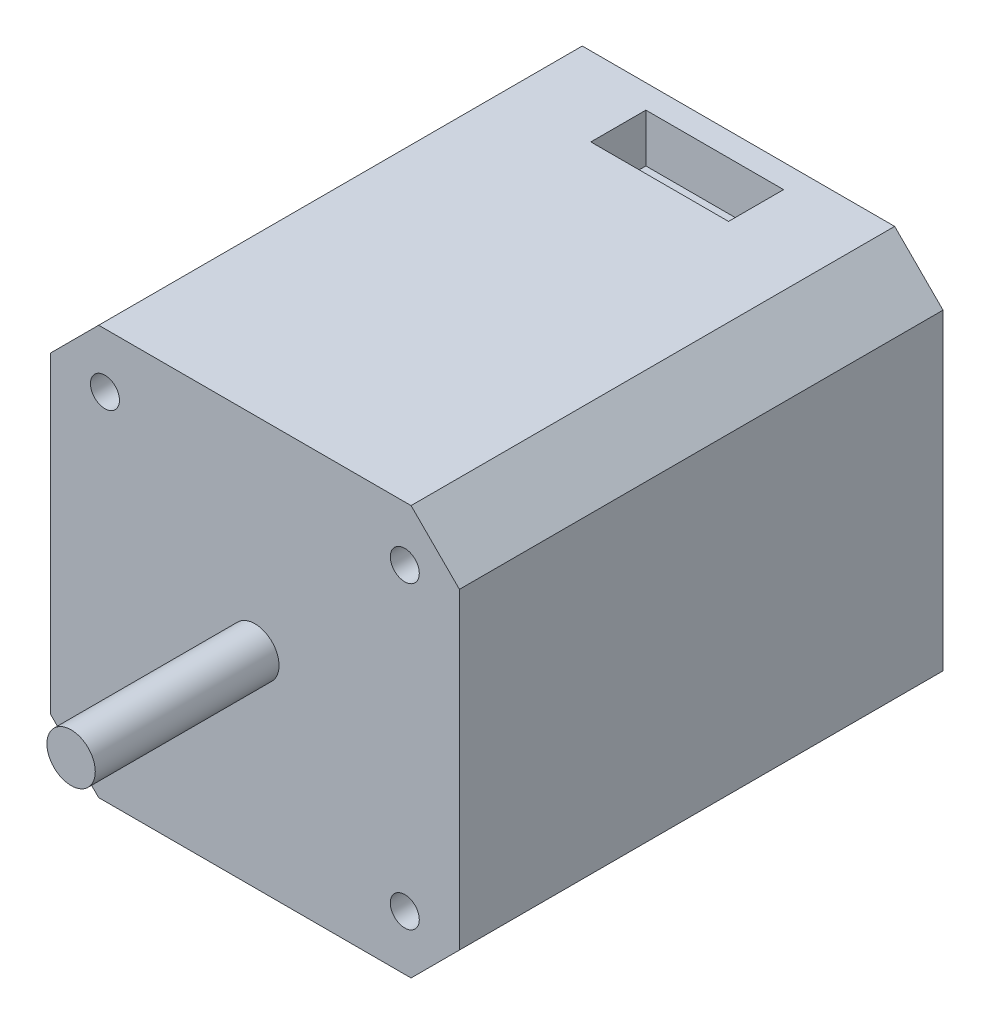
ISO-10303-21;
HEADER;
FILE_DESCRIPTION(('STEP AP214'),'2;1');
FILE_NAME('part.step','',(''),(''),'','','');
FILE_SCHEMA(('AUTOMOTIVE_DESIGN { 1 0 10303 214 1 1 1 1 }'));
ENDSEC;
DATA;
#1=APPLICATION_CONTEXT('core data for automotive mechanical design processes');
#2=APPLICATION_PROTOCOL_DEFINITION('international standard','automotive_design',2000,#1);
#3=PRODUCT_CONTEXT('',#1,'mechanical');
#4=PRODUCT('Part','Part','',(#3));
#5=PRODUCT_RELATED_PRODUCT_CATEGORY('part','',(#4));
#6=PRODUCT_DEFINITION_FORMATION('','',#4);
#7=PRODUCT_DEFINITION_CONTEXT('part definition',#1,'design');
#8=PRODUCT_DEFINITION('design','',#6,#7);
#9=PRODUCT_DEFINITION_SHAPE('','',#8);
#10=(LENGTH_UNIT() NAMED_UNIT(*) SI_UNIT(.MILLI.,.METRE.));
#11=(NAMED_UNIT(*) PLANE_ANGLE_UNIT() SI_UNIT($,.RADIAN.));
#12=(NAMED_UNIT(*) SI_UNIT($,.STERADIAN.) SOLID_ANGLE_UNIT());
#13=UNCERTAINTY_MEASURE_WITH_UNIT(LENGTH_MEASURE(1.E-05),#10,'distance_accuracy_value','');
#14=(GEOMETRIC_REPRESENTATION_CONTEXT(3) GLOBAL_UNCERTAINTY_ASSIGNED_CONTEXT((#13)) GLOBAL_UNIT_ASSIGNED_CONTEXT((#10,
#11,#12)) REPRESENTATION_CONTEXT('',''));
#15=CARTESIAN_POINT('',(0.,0.,0.));
#16=DIRECTION('',(0.,0.,1.));
#17=DIRECTION('',(1.,0.,0.));
#18=AXIS2_PLACEMENT_3D('',#15,#16,#17);
#19=CARTESIAN_POINT('',(0.,0.,74.));
#20=DIRECTION('',(0.,0.,-1.));
#21=DIRECTION('',(-1.,0.,0.));
#22=AXIS2_PLACEMENT_3D('',#19,#20,#21);
#23=CYLINDRICAL_SURFACE('',#22,2.5);
#24=CARTESIAN_POINT('',(0.,0.,50.));
#25=DIRECTION('',(0.,0.,1.));
#26=DIRECTION('',(1.,0.,0.));
#27=AXIS2_PLACEMENT_3D('',#24,#25,#26);
#28=CIRCLE('',#27,2.5);
#29=CARTESIAN_POINT('',(2.5,0.,50.));
#30=VERTEX_POINT('',#29);
#31=EDGE_CURVE('E147',#30,#30,#28,.T.);
#32=ORIENTED_EDGE('',*,*,#31,.T.);
#33=EDGE_LOOP('',(#32));
#34=FACE_BOUND('',#33,.T.);
#35=CARTESIAN_POINT('',(0.,0.,69.));
#36=DIRECTION('',(0.,0.,1.));
#37=DIRECTION('',(1.,0.,0.));
#38=AXIS2_PLACEMENT_3D('',#35,#36,#37);
#39=CIRCLE('',#38,2.5);
#40=CARTESIAN_POINT('',(2.5,0.,69.));
#41=VERTEX_POINT('',#40);
#42=EDGE_CURVE('E240',#41,#41,#39,.T.);
#43=ORIENTED_EDGE('',*,*,#42,.F.);
#44=EDGE_LOOP('',(#43));
#45=FACE_BOUND('',#44,.T.);
#46=ADVANCED_FACE('F34',(#34,#45),#23,.T.);
#47=CARTESIAN_POINT('',(-21.15,16.15,50.));
#48=DIRECTION('',(1.,0.,0.));
#49=DIRECTION('',(0.,1.,0.));
#50=AXIS2_PLACEMENT_3D('',#47,#48,#49);
#51=PLANE('',#50);
#52=DIRECTION('',(0.,-1.,0.));
#53=VECTOR('',#52,1.);
#54=CARTESIAN_POINT('',(-21.15,16.15,0.));
#55=LINE('',#54,#53);
#56=CARTESIAN_POINT('',(-21.15,16.15,0.));
#57=VERTEX_POINT('',#56);
#58=CARTESIAN_POINT('',(-21.15,-16.15,0.));
#59=VERTEX_POINT('',#58);
#60=EDGE_CURVE('E143',#57,#59,#55,.T.);
#61=ORIENTED_EDGE('',*,*,#60,.T.);
#62=DIRECTION('',(0.,0.,-1.));
#63=VECTOR('',#62,1.);
#64=CARTESIAN_POINT('',(-21.15,-16.15,50.));
#65=LINE('',#64,#63);
#66=CARTESIAN_POINT('',(-21.15,-16.15,50.));
#67=VERTEX_POINT('',#66);
#68=EDGE_CURVE('E11',#67,#59,#65,.T.);
#69=ORIENTED_EDGE('',*,*,#68,.F.);
#70=DIRECTION('',(0.,-1.,0.));
#71=VECTOR('',#70,1.);
#72=CARTESIAN_POINT('',(-21.15,16.15,50.));
#73=LINE('',#72,#71);
#74=CARTESIAN_POINT('',(-21.15,16.15,50.));
#75=VERTEX_POINT('',#74);
#76=EDGE_CURVE('E159',#75,#67,#73,.T.);
#77=ORIENTED_EDGE('',*,*,#76,.F.);
#78=DIRECTION('',(0.,0.,-1.));
#79=VECTOR('',#78,1.);
#80=CARTESIAN_POINT('',(-21.15,16.15,50.));
#81=LINE('',#80,#79);
#82=EDGE_CURVE('E139',#75,#57,#81,.T.);
#83=ORIENTED_EDGE('',*,*,#82,.T.);
#84=EDGE_LOOP('',(#61,#69,#77,#83));
#85=FACE_BOUND('',#84,.T.);
#86=ADVANCED_FACE('F36',(#85),#51,.F.);
#87=CARTESIAN_POINT('',(-21.15,-16.15,50.));
#88=DIRECTION('',(0.707106781186548,0.707106781186548,0.));
#89=DIRECTION('',(-0.707106781186548,0.707106781186548,0.));
#90=AXIS2_PLACEMENT_3D('',#87,#88,#89);
#91=PLANE('',#90);
#92=DIRECTION('',(0.707106781186548,-0.707106781186548,0.));
#93=VECTOR('',#92,1.);
#94=CARTESIAN_POINT('',(-21.15,-16.15,0.));
#95=LINE('',#94,#93);
#96=CARTESIAN_POINT('',(-16.15,-21.15,0.));
#97=VERTEX_POINT('',#96);
#98=EDGE_CURVE('E146',#59,#97,#95,.T.);
#99=ORIENTED_EDGE('',*,*,#98,.T.);
#100=DIRECTION('',(0.,0.,-1.));
#101=VECTOR('',#100,1.);
#102=CARTESIAN_POINT('',(-16.15,-21.15,50.));
#103=LINE('',#102,#101);
#104=CARTESIAN_POINT('',(-16.15,-21.15,50.));
#105=VERTEX_POINT('',#104);
#106=EDGE_CURVE('E42',#105,#97,#103,.T.);
#107=ORIENTED_EDGE('',*,*,#106,.F.);
#108=DIRECTION('',(0.707106781186548,-0.707106781186548,0.));
#109=VECTOR('',#108,1.);
#110=CARTESIAN_POINT('',(-21.15,-16.15,50.));
#111=LINE('',#110,#109);
#112=EDGE_CURVE('E99',#67,#105,#111,.T.);
#113=ORIENTED_EDGE('',*,*,#112,.F.);
#114=ORIENTED_EDGE('',*,*,#68,.T.);
#115=EDGE_LOOP('',(#99,#107,#113,#114));
#116=FACE_BOUND('',#115,.T.);
#117=ADVANCED_FACE('F262',(#116),#91,.F.);
#118=CARTESIAN_POINT('',(-16.15,-21.15,50.));
#119=DIRECTION('',(0.,1.,0.));
#120=DIRECTION('',(-1.,0.,0.));
#121=AXIS2_PLACEMENT_3D('',#118,#119,#120);
#122=PLANE('',#121);
#123=DIRECTION('',(1.,0.,0.));
#124=VECTOR('',#123,1.);
#125=CARTESIAN_POINT('',(-16.15,-21.15,0.));
#126=LINE('',#125,#124);
#127=CARTESIAN_POINT('',(16.15,-21.15,0.));
#128=VERTEX_POINT('',#127);
#129=EDGE_CURVE('E149',#97,#128,#126,.T.);
#130=ORIENTED_EDGE('',*,*,#129,.T.);
#131=DIRECTION('',(0.,0.,-1.));
#132=VECTOR('',#131,1.);
#133=CARTESIAN_POINT('',(16.15,-21.15,50.));
#134=LINE('',#133,#132);
#135=CARTESIAN_POINT('',(16.15,-21.15,50.));
#136=VERTEX_POINT('',#135);
#137=EDGE_CURVE('E166',#136,#128,#134,.T.);
#138=ORIENTED_EDGE('',*,*,#137,.F.);
#139=DIRECTION('',(1.,0.,0.));
#140=VECTOR('',#139,1.);
#141=CARTESIAN_POINT('',(-16.15,-21.15,50.));
#142=LINE('',#141,#140);
#143=EDGE_CURVE('E174',#105,#136,#142,.T.);
#144=ORIENTED_EDGE('',*,*,#143,.F.);
#145=ORIENTED_EDGE('',*,*,#106,.T.);
#146=EDGE_LOOP('',(#130,#138,#144,#145));
#147=FACE_BOUND('',#146,.T.);
#148=ADVANCED_FACE('F172',(#147),#122,.F.);
#149=CARTESIAN_POINT('',(21.15,-16.15,50.));
#150=DIRECTION('',(-0.707106781186548,0.707106781186548,0.));
#151=DIRECTION('',(-0.707106781186548,-0.707106781186548,0.));
#152=AXIS2_PLACEMENT_3D('',#149,#150,#151);
#153=PLANE('',#152);
#154=DIRECTION('',(0.707106781186548,0.707106781186548,0.));
#155=VECTOR('',#154,1.);
#156=CARTESIAN_POINT('',(21.15,-16.15,0.));
#157=LINE('',#156,#155);
#158=CARTESIAN_POINT('',(21.15,-16.15,0.));
#159=VERTEX_POINT('',#158);
#160=EDGE_CURVE('E151',#128,#159,#157,.T.);
#161=ORIENTED_EDGE('',*,*,#160,.T.);
#162=DIRECTION('',(0.,0.,-1.));
#163=VECTOR('',#162,1.);
#164=CARTESIAN_POINT('',(21.15,-16.15,50.));
#165=LINE('',#164,#163);
#166=CARTESIAN_POINT('',(21.15,-16.15,50.));
#167=VERTEX_POINT('',#166);
#168=EDGE_CURVE('E163',#167,#159,#165,.T.);
#169=ORIENTED_EDGE('',*,*,#168,.F.);
#170=DIRECTION('',(0.707106781186548,0.707106781186548,0.));
#171=VECTOR('',#170,1.);
#172=CARTESIAN_POINT('',(21.15,-16.15,50.));
#173=LINE('',#172,#171);
#174=EDGE_CURVE('E186',#136,#167,#173,.T.);
#175=ORIENTED_EDGE('',*,*,#174,.F.);
#176=ORIENTED_EDGE('',*,*,#137,.T.);
#177=EDGE_LOOP('',(#161,#169,#175,#176));
#178=FACE_BOUND('',#177,.T.);
#179=ADVANCED_FACE('F182',(#178),#153,.F.);
#180=CARTESIAN_POINT('',(21.15,16.15,50.));
#181=DIRECTION('',(-1.,0.,0.));
#182=DIRECTION('',(0.,-1.,0.));
#183=AXIS2_PLACEMENT_3D('',#180,#181,#182);
#184=PLANE('',#183);
#185=DIRECTION('',(0.,1.,0.));
#186=VECTOR('',#185,1.);
#187=CARTESIAN_POINT('',(21.15,16.15,0.));
#188=LINE('',#187,#186);
#189=CARTESIAN_POINT('',(21.15,16.15,0.));
#190=VERTEX_POINT('',#189);
#191=EDGE_CURVE('E153',#159,#190,#188,.T.);
#192=ORIENTED_EDGE('',*,*,#191,.T.);
#193=DIRECTION('',(0.,0.,-1.));
#194=VECTOR('',#193,1.);
#195=CARTESIAN_POINT('',(21.15,16.15,50.));
#196=LINE('',#195,#194);
#197=CARTESIAN_POINT('',(21.15,16.15,50.));
#198=VERTEX_POINT('',#197);
#199=EDGE_CURVE('E134',#198,#190,#196,.T.);
#200=ORIENTED_EDGE('',*,*,#199,.F.);
#201=DIRECTION('',(0.,1.,0.));
#202=VECTOR('',#201,1.);
#203=CARTESIAN_POINT('',(21.15,16.15,50.));
#204=LINE('',#203,#202);
#205=EDGE_CURVE('E122',#167,#198,#204,.T.);
#206=ORIENTED_EDGE('',*,*,#205,.F.);
#207=ORIENTED_EDGE('',*,*,#168,.T.);
#208=EDGE_LOOP('',(#192,#200,#206,#207));
#209=FACE_BOUND('',#208,.T.);
#210=ADVANCED_FACE('F185',(#209),#184,.F.);
#211=CARTESIAN_POINT('',(16.15,21.15,50.));
#212=DIRECTION('',(-0.707106781186548,-0.707106781186548,0.));
#213=DIRECTION('',(0.707106781186548,-0.707106781186548,0.));
#214=AXIS2_PLACEMENT_3D('',#211,#212,#213);
#215=PLANE('',#214);
#216=DIRECTION('',(-0.707106781186548,0.707106781186548,0.));
#217=VECTOR('',#216,1.);
#218=CARTESIAN_POINT('',(16.15,21.15,0.));
#219=LINE('',#218,#217);
#220=CARTESIAN_POINT('',(16.15,21.15,0.));
#221=VERTEX_POINT('',#220);
#222=EDGE_CURVE('E131',#190,#221,#219,.T.);
#223=ORIENTED_EDGE('',*,*,#222,.T.);
#224=DIRECTION('',(0.,0.,-1.));
#225=VECTOR('',#224,1.);
#226=CARTESIAN_POINT('',(16.15,21.15,50.));
#227=LINE('',#226,#225);
#228=CARTESIAN_POINT('',(16.15,21.15,50.));
#229=VERTEX_POINT('',#228);
#230=EDGE_CURVE('E128',#229,#221,#227,.T.);
#231=ORIENTED_EDGE('',*,*,#230,.F.);
#232=DIRECTION('',(-0.707106781186548,0.707106781186548,0.));
#233=VECTOR('',#232,1.);
#234=CARTESIAN_POINT('',(16.15,21.15,50.));
#235=LINE('',#234,#233);
#236=EDGE_CURVE('E115',#198,#229,#235,.T.);
#237=ORIENTED_EDGE('',*,*,#236,.F.);
#238=ORIENTED_EDGE('',*,*,#199,.T.);
#239=EDGE_LOOP('',(#223,#231,#237,#238));
#240=FACE_BOUND('',#239,.T.);
#241=ADVANCED_FACE('F129',(#240),#215,.F.);
#242=CARTESIAN_POINT('',(-16.15,21.15,50.));
#243=DIRECTION('',(0.,-1.,0.));
#244=DIRECTION('',(0.,0.,-1.));
#245=AXIS2_PLACEMENT_3D('',#242,#243,#244);
#246=PLANE('',#245);
#247=DIRECTION('',(-1.,0.,0.));
#248=VECTOR('',#247,1.);
#249=CARTESIAN_POINT('',(-7.11788042547959,21.15,2.45205438317747));
#250=LINE('',#249,#248);
#251=CARTESIAN_POINT('',(7.11788042547959,21.15,2.45205438317747));
#252=VERTEX_POINT('',#251);
#253=CARTESIAN_POINT('',(-7.11788042547959,21.15,2.45205438317747));
#254=VERTEX_POINT('',#253);
#255=EDGE_CURVE('E236',#252,#254,#250,.T.);
#256=ORIENTED_EDGE('',*,*,#255,.F.);
#257=DIRECTION('',(0.,0.,-1.));
#258=VECTOR('',#257,1.);
#259=CARTESIAN_POINT('',(7.11788042547959,21.15,8.14635872356113));
#260=LINE('',#259,#258);
#261=CARTESIAN_POINT('',(7.11788042547959,21.15,8.14635872356113));
#262=VERTEX_POINT('',#261);
#263=EDGE_CURVE('E49',#262,#252,#260,.T.);
#264=ORIENTED_EDGE('',*,*,#263,.F.);
#265=DIRECTION('',(1.,0.,0.));
#266=VECTOR('',#265,1.);
#267=CARTESIAN_POINT('',(-7.11788042547959,21.15,8.14635872356113));
#268=LINE('',#267,#266);
#269=CARTESIAN_POINT('',(-7.11788042547959,21.15,8.14635872356113));
#270=VERTEX_POINT('',#269);
#271=EDGE_CURVE('E229',#270,#262,#268,.T.);
#272=ORIENTED_EDGE('',*,*,#271,.F.);
#273=DIRECTION('',(0.,0.,1.));
#274=VECTOR('',#273,1.);
#275=CARTESIAN_POINT('',(-7.11788042547959,21.15,8.14635872356113));
#276=LINE('',#275,#274);
#277=EDGE_CURVE('E233',#254,#270,#276,.T.);
#278=ORIENTED_EDGE('',*,*,#277,.F.);
#279=EDGE_LOOP('',(#256,#264,#272,#278));
#280=FACE_BOUND('',#279,.T.);
#281=DIRECTION('',(-1.,0.,0.));
#282=VECTOR('',#281,1.);
#283=CARTESIAN_POINT('',(-16.15,21.15,0.));
#284=LINE('',#283,#282);
#285=CARTESIAN_POINT('',(-16.15,21.15,0.));
#286=VERTEX_POINT('',#285);
#287=EDGE_CURVE('E156',#221,#286,#284,.T.);
#288=ORIENTED_EDGE('',*,*,#287,.T.);
#289=DIRECTION('',(0.,0.,-1.));
#290=VECTOR('',#289,1.);
#291=CARTESIAN_POINT('',(-16.15,21.15,50.));
#292=LINE('',#291,#290);
#293=CARTESIAN_POINT('',(-16.15,21.15,50.));
#294=VERTEX_POINT('',#293);
#295=EDGE_CURVE('E135',#294,#286,#292,.T.);
#296=ORIENTED_EDGE('',*,*,#295,.F.);
#297=DIRECTION('',(-1.,0.,0.));
#298=VECTOR('',#297,1.);
#299=CARTESIAN_POINT('',(-16.15,21.15,50.));
#300=LINE('',#299,#298);
#301=EDGE_CURVE('E119',#229,#294,#300,.T.);
#302=ORIENTED_EDGE('',*,*,#301,.F.);
#303=ORIENTED_EDGE('',*,*,#230,.T.);
#304=EDGE_LOOP('',(#288,#296,#302,#303));
#305=FACE_BOUND('',#304,.T.);
#306=ADVANCED_FACE('F137',(#280,#305),#246,.F.);
#307=CARTESIAN_POINT('',(-16.15,21.15,50.));
#308=DIRECTION('',(0.707106781186548,-0.707106781186548,0.));
#309=DIRECTION('',(0.707106781186548,0.707106781186548,0.));
#310=AXIS2_PLACEMENT_3D('',#307,#308,#309);
#311=PLANE('',#310);
#312=DIRECTION('',(-0.707106781186548,-0.707106781186548,0.));
#313=VECTOR('',#312,1.);
#314=CARTESIAN_POINT('',(-16.15,21.15,0.));
#315=LINE('',#314,#313);
#316=EDGE_CURVE('E91',#286,#57,#315,.T.);
#317=ORIENTED_EDGE('',*,*,#316,.T.);
#318=ORIENTED_EDGE('',*,*,#82,.F.);
#319=DIRECTION('',(-0.707106781186548,-0.707106781186548,0.));
#320=VECTOR('',#319,1.);
#321=CARTESIAN_POINT('',(-16.15,21.15,50.));
#322=LINE('',#321,#320);
#323=EDGE_CURVE('E58',#294,#75,#322,.T.);
#324=ORIENTED_EDGE('',*,*,#323,.F.);
#325=ORIENTED_EDGE('',*,*,#295,.T.);
#326=EDGE_LOOP('',(#317,#318,#324,#325));
#327=FACE_BOUND('',#326,.T.);
#328=ADVANCED_FACE('F270',(#327),#311,.F.);
#329=CARTESIAN_POINT('',(0.,0.,50.));
#330=DIRECTION('',(0.,0.,1.));
#331=DIRECTION('',(1.,0.,0.));
#332=AXIS2_PLACEMENT_3D('',#329,#330,#331);
#333=PLANE('',#332);
#334=CARTESIAN_POINT('',(-15.5,-15.5,50.));
#335=DIRECTION('',(0.,0.,1.));
#336=DIRECTION('',(1.,0.,0.));
#337=AXIS2_PLACEMENT_3D('',#334,#335,#336);
#338=CIRCLE('',#337,1.5);
#339=CARTESIAN_POINT('',(-14.,-15.5,50.));
#340=VERTEX_POINT('',#339);
#341=EDGE_CURVE('E214',#340,#340,#338,.T.);
#342=ORIENTED_EDGE('',*,*,#341,.F.);
#343=EDGE_LOOP('',(#342));
#344=FACE_BOUND('',#343,.T.);
#345=CARTESIAN_POINT('',(15.5,-15.5,50.));
#346=DIRECTION('',(0.,0.,1.));
#347=DIRECTION('',(1.,0.,0.));
#348=AXIS2_PLACEMENT_3D('',#345,#346,#347);
#349=CIRCLE('',#348,1.5);
#350=CARTESIAN_POINT('',(17.,-15.5,50.));
#351=VERTEX_POINT('',#350);
#352=EDGE_CURVE('E208',#351,#351,#349,.T.);
#353=ORIENTED_EDGE('',*,*,#352,.F.);
#354=EDGE_LOOP('',(#353));
#355=FACE_BOUND('',#354,.T.);
#356=CARTESIAN_POINT('',(15.5,15.5,50.));
#357=DIRECTION('',(0.,0.,1.));
#358=DIRECTION('',(1.,0.,0.));
#359=AXIS2_PLACEMENT_3D('',#356,#357,#358);
#360=CIRCLE('',#359,1.5);
#361=CARTESIAN_POINT('',(17.,15.5,50.));
#362=VERTEX_POINT('',#361);
#363=EDGE_CURVE('E201',#362,#362,#360,.T.);
#364=ORIENTED_EDGE('',*,*,#363,.F.);
#365=EDGE_LOOP('',(#364));
#366=FACE_BOUND('',#365,.T.);
#367=CARTESIAN_POINT('',(-15.5,15.5,50.));
#368=DIRECTION('',(0.,0.,1.));
#369=DIRECTION('',(1.,0.,0.));
#370=AXIS2_PLACEMENT_3D('',#367,#368,#369);
#371=CIRCLE('',#370,1.5);
#372=CARTESIAN_POINT('',(-14.,15.5,50.));
#373=VERTEX_POINT('',#372);
#374=EDGE_CURVE('E195',#373,#373,#371,.T.);
#375=ORIENTED_EDGE('',*,*,#374,.F.);
#376=EDGE_LOOP('',(#375));
#377=FACE_BOUND('',#376,.T.);
#378=ORIENTED_EDGE('',*,*,#31,.F.);
#379=EDGE_LOOP('',(#378));
#380=FACE_BOUND('',#379,.T.);
#381=ORIENTED_EDGE('',*,*,#76,.T.);
#382=ORIENTED_EDGE('',*,*,#112,.T.);
#383=ORIENTED_EDGE('',*,*,#143,.T.);
#384=ORIENTED_EDGE('',*,*,#174,.T.);
#385=ORIENTED_EDGE('',*,*,#205,.T.);
#386=ORIENTED_EDGE('',*,*,#236,.T.);
#387=ORIENTED_EDGE('',*,*,#301,.T.);
#388=ORIENTED_EDGE('',*,*,#323,.T.);
#389=EDGE_LOOP('',(#381,#382,#383,#384,#385,#386,#387,#388));
#390=FACE_BOUND('',#389,.T.);
#391=ADVANCED_FACE('F117',(#344,#355,#366,#377,#380,#390),#333,.T.);
#392=CARTESIAN_POINT('',(0.,0.,0.));
#393=DIRECTION('',(0.,0.,1.));
#394=DIRECTION('',(1.,0.,0.));
#395=AXIS2_PLACEMENT_3D('',#392,#393,#394);
#396=PLANE('',#395);
#397=ORIENTED_EDGE('',*,*,#60,.F.);
#398=ORIENTED_EDGE('',*,*,#316,.F.);
#399=ORIENTED_EDGE('',*,*,#287,.F.);
#400=ORIENTED_EDGE('',*,*,#222,.F.);
#401=ORIENTED_EDGE('',*,*,#191,.F.);
#402=ORIENTED_EDGE('',*,*,#160,.F.);
#403=ORIENTED_EDGE('',*,*,#129,.F.);
#404=ORIENTED_EDGE('',*,*,#98,.F.);
#405=EDGE_LOOP('',(#397,#398,#399,#400,#401,#402,#403,#404));
#406=FACE_BOUND('',#405,.T.);
#407=ADVANCED_FACE('F178',(#406),#396,.F.);
#408=CARTESIAN_POINT('',(-15.5,15.5,26.));
#409=DIRECTION('',(0.,0.,1.));
#410=DIRECTION('',(1.,0.,0.));
#411=AXIS2_PLACEMENT_3D('',#408,#409,#410);
#412=CYLINDRICAL_SURFACE('',#411,1.5);
#413=CARTESIAN_POINT('',(-15.5,15.5,26.));
#414=DIRECTION('',(0.,0.,1.));
#415=DIRECTION('',(1.,0.,0.));
#416=AXIS2_PLACEMENT_3D('',#413,#414,#415);
#417=CIRCLE('',#416,1.5);
#418=CARTESIAN_POINT('',(-14.,15.5,26.));
#419=VERTEX_POINT('',#418);
#420=EDGE_CURVE('E194',#419,#419,#417,.T.);
#421=ORIENTED_EDGE('',*,*,#420,.F.);
#422=EDGE_LOOP('',(#421));
#423=FACE_BOUND('',#422,.T.);
#424=ORIENTED_EDGE('',*,*,#374,.T.);
#425=EDGE_LOOP('',(#424));
#426=FACE_BOUND('',#425,.T.);
#427=ADVANCED_FACE('F266',(#423,#426),#412,.F.);
#428=CARTESIAN_POINT('',(-15.5,15.5,26.));
#429=DIRECTION('',(0.,0.,1.));
#430=DIRECTION('',(1.,0.,0.));
#431=AXIS2_PLACEMENT_3D('',#428,#429,#430);
#432=PLANE('',#431);
#433=ORIENTED_EDGE('',*,*,#420,.T.);
#434=EDGE_LOOP('',(#433));
#435=FACE_BOUND('',#434,.T.);
#436=ADVANCED_FACE('F333',(#435),#432,.T.);
#437=CARTESIAN_POINT('',(15.5,15.5,26.));
#438=DIRECTION('',(0.,0.,1.));
#439=DIRECTION('',(1.,0.,0.));
#440=AXIS2_PLACEMENT_3D('',#437,#438,#439);
#441=CYLINDRICAL_SURFACE('',#440,1.5);
#442=CARTESIAN_POINT('',(15.5,15.5,26.));
#443=DIRECTION('',(0.,0.,1.));
#444=DIRECTION('',(1.,0.,0.));
#445=AXIS2_PLACEMENT_3D('',#442,#443,#444);
#446=CIRCLE('',#445,1.5);
#447=CARTESIAN_POINT('',(17.,15.5,26.));
#448=VERTEX_POINT('',#447);
#449=EDGE_CURVE('E204',#448,#448,#446,.T.);
#450=ORIENTED_EDGE('',*,*,#449,.F.);
#451=EDGE_LOOP('',(#450));
#452=FACE_BOUND('',#451,.T.);
#453=ORIENTED_EDGE('',*,*,#363,.T.);
#454=EDGE_LOOP('',(#453));
#455=FACE_BOUND('',#454,.T.);
#456=ADVANCED_FACE('F340',(#452,#455),#441,.F.);
#457=CARTESIAN_POINT('',(15.5,15.5,26.));
#458=DIRECTION('',(0.,0.,1.));
#459=DIRECTION('',(1.,0.,0.));
#460=AXIS2_PLACEMENT_3D('',#457,#458,#459);
#461=PLANE('',#460);
#462=ORIENTED_EDGE('',*,*,#449,.T.);
#463=EDGE_LOOP('',(#462));
#464=FACE_BOUND('',#463,.T.);
#465=ADVANCED_FACE('F347',(#464),#461,.T.);
#466=CARTESIAN_POINT('',(15.5,-15.5,26.));
#467=DIRECTION('',(0.,0.,1.));
#468=DIRECTION('',(1.,0.,0.));
#469=AXIS2_PLACEMENT_3D('',#466,#467,#468);
#470=CYLINDRICAL_SURFACE('',#469,1.5);
#471=CARTESIAN_POINT('',(15.5,-15.5,26.));
#472=DIRECTION('',(0.,0.,1.));
#473=DIRECTION('',(1.,0.,0.));
#474=AXIS2_PLACEMENT_3D('',#471,#472,#473);
#475=CIRCLE('',#474,1.5);
#476=CARTESIAN_POINT('',(17.,-15.5,26.));
#477=VERTEX_POINT('',#476);
#478=EDGE_CURVE('E211',#477,#477,#475,.T.);
#479=ORIENTED_EDGE('',*,*,#478,.F.);
#480=EDGE_LOOP('',(#479));
#481=FACE_BOUND('',#480,.T.);
#482=ORIENTED_EDGE('',*,*,#352,.T.);
#483=EDGE_LOOP('',(#482));
#484=FACE_BOUND('',#483,.T.);
#485=ADVANCED_FACE('F355',(#481,#484),#470,.F.);
#486=CARTESIAN_POINT('',(15.5,-15.5,26.));
#487=DIRECTION('',(0.,0.,1.));
#488=DIRECTION('',(1.,0.,0.));
#489=AXIS2_PLACEMENT_3D('',#486,#487,#488);
#490=PLANE('',#489);
#491=ORIENTED_EDGE('',*,*,#478,.T.);
#492=EDGE_LOOP('',(#491));
#493=FACE_BOUND('',#492,.T.);
#494=ADVANCED_FACE('F363',(#493),#490,.T.);
#495=CARTESIAN_POINT('',(-15.5,-15.5,26.));
#496=DIRECTION('',(0.,0.,1.));
#497=DIRECTION('',(1.,0.,0.));
#498=AXIS2_PLACEMENT_3D('',#495,#496,#497);
#499=CYLINDRICAL_SURFACE('',#498,1.5);
#500=CARTESIAN_POINT('',(-15.5,-15.5,26.));
#501=DIRECTION('',(0.,0.,1.));
#502=DIRECTION('',(1.,0.,0.));
#503=AXIS2_PLACEMENT_3D('',#500,#501,#502);
#504=CIRCLE('',#503,1.5);
#505=CARTESIAN_POINT('',(-14.,-15.5,26.));
#506=VERTEX_POINT('',#505);
#507=EDGE_CURVE('E198',#506,#506,#504,.T.);
#508=ORIENTED_EDGE('',*,*,#507,.F.);
#509=EDGE_LOOP('',(#508));
#510=FACE_BOUND('',#509,.T.);
#511=ORIENTED_EDGE('',*,*,#341,.T.);
#512=EDGE_LOOP('',(#511));
#513=FACE_BOUND('',#512,.T.);
#514=ADVANCED_FACE('F371',(#510,#513),#499,.F.);
#515=CARTESIAN_POINT('',(-15.5,-15.5,26.));
#516=DIRECTION('',(0.,0.,1.));
#517=DIRECTION('',(1.,0.,0.));
#518=AXIS2_PLACEMENT_3D('',#515,#516,#517);
#519=PLANE('',#518);
#520=ORIENTED_EDGE('',*,*,#507,.T.);
#521=EDGE_LOOP('',(#520));
#522=FACE_BOUND('',#521,.T.);
#523=ADVANCED_FACE('F379',(#522),#519,.T.);
#524=CARTESIAN_POINT('',(7.11788042547959,16.15,8.14635872356113));
#525=DIRECTION('',(1.,0.,0.));
#526=DIRECTION('',(0.,0.,-1.));
#527=AXIS2_PLACEMENT_3D('',#524,#525,#526);
#528=PLANE('',#527);
#529=ORIENTED_EDGE('',*,*,#263,.T.);
#530=DIRECTION('',(0.,1.,0.));
#531=VECTOR('',#530,1.);
#532=CARTESIAN_POINT('',(7.11788042547959,16.15,2.45205438317747));
#533=LINE('',#532,#531);
#534=CARTESIAN_POINT('',(7.11788042547959,16.15,2.45205438317747));
#535=VERTEX_POINT('',#534);
#536=EDGE_CURVE('E219',#535,#252,#533,.T.);
#537=ORIENTED_EDGE('',*,*,#536,.F.);
#538=DIRECTION('',(0.,0.,-1.));
#539=VECTOR('',#538,1.);
#540=CARTESIAN_POINT('',(7.11788042547959,16.15,8.14635872356113));
#541=LINE('',#540,#539);
#542=CARTESIAN_POINT('',(7.11788042547959,16.15,8.14635872356113));
#543=VERTEX_POINT('',#542);
#544=EDGE_CURVE('E232',#543,#535,#541,.T.);
#545=ORIENTED_EDGE('',*,*,#544,.F.);
#546=DIRECTION('',(0.,1.,0.));
#547=VECTOR('',#546,1.);
#548=CARTESIAN_POINT('',(7.11788042547959,16.15,8.14635872356113));
#549=LINE('',#548,#547);
#550=EDGE_CURVE('E205',#543,#262,#549,.T.);
#551=ORIENTED_EDGE('',*,*,#550,.T.);
#552=EDGE_LOOP('',(#529,#537,#545,#551));
#553=FACE_BOUND('',#552,.T.);
#554=ADVANCED_FACE('F386',(#553),#528,.F.);
#555=CARTESIAN_POINT('',(-7.11788042547959,16.15,8.14635872356113));
#556=DIRECTION('',(0.,0.,1.));
#557=DIRECTION('',(1.,0.,0.));
#558=AXIS2_PLACEMENT_3D('',#555,#556,#557);
#559=PLANE('',#558);
#560=ORIENTED_EDGE('',*,*,#271,.T.);
#561=ORIENTED_EDGE('',*,*,#550,.F.);
#562=DIRECTION('',(1.,0.,0.));
#563=VECTOR('',#562,1.);
#564=CARTESIAN_POINT('',(-7.11788042547959,16.15,8.14635872356113));
#565=LINE('',#564,#563);
#566=CARTESIAN_POINT('',(-7.11788042547959,16.15,8.14635872356113));
#567=VERTEX_POINT('',#566);
#568=EDGE_CURVE('E222',#567,#543,#565,.T.);
#569=ORIENTED_EDGE('',*,*,#568,.F.);
#570=DIRECTION('',(0.,1.,0.));
#571=VECTOR('',#570,1.);
#572=CARTESIAN_POINT('',(-7.11788042547959,16.15,8.14635872356113));
#573=LINE('',#572,#571);
#574=EDGE_CURVE('E225',#567,#270,#573,.T.);
#575=ORIENTED_EDGE('',*,*,#574,.T.);
#576=EDGE_LOOP('',(#560,#561,#569,#575));
#577=FACE_BOUND('',#576,.T.);
#578=ADVANCED_FACE('F393',(#577),#559,.F.);
#579=CARTESIAN_POINT('',(-7.11788042547959,16.15,8.14635872356113));
#580=DIRECTION('',(-1.,0.,0.));
#581=DIRECTION('',(0.,0.,1.));
#582=AXIS2_PLACEMENT_3D('',#579,#580,#581);
#583=PLANE('',#582);
#584=ORIENTED_EDGE('',*,*,#277,.T.);
#585=ORIENTED_EDGE('',*,*,#574,.F.);
#586=DIRECTION('',(0.,0.,1.));
#587=VECTOR('',#586,1.);
#588=CARTESIAN_POINT('',(-7.11788042547959,16.15,8.14635872356113));
#589=LINE('',#588,#587);
#590=CARTESIAN_POINT('',(-7.11788042547959,16.15,2.45205438317747));
#591=VERTEX_POINT('',#590);
#592=EDGE_CURVE('E243',#591,#567,#589,.T.);
#593=ORIENTED_EDGE('',*,*,#592,.F.);
#594=DIRECTION('',(0.,1.,0.));
#595=VECTOR('',#594,1.);
#596=CARTESIAN_POINT('',(-7.11788042547959,16.15,2.45205438317747));
#597=LINE('',#596,#595);
#598=EDGE_CURVE('E221',#591,#254,#597,.T.);
#599=ORIENTED_EDGE('',*,*,#598,.T.);
#600=EDGE_LOOP('',(#584,#585,#593,#599));
#601=FACE_BOUND('',#600,.T.);
#602=ADVANCED_FACE('F400',(#601),#583,.F.);
#603=CARTESIAN_POINT('',(-7.11788042547959,16.15,2.45205438317747));
#604=DIRECTION('',(0.,0.,-1.));
#605=DIRECTION('',(-1.,0.,0.));
#606=AXIS2_PLACEMENT_3D('',#603,#604,#605);
#607=PLANE('',#606);
#608=ORIENTED_EDGE('',*,*,#255,.T.);
#609=ORIENTED_EDGE('',*,*,#598,.F.);
#610=DIRECTION('',(-1.,0.,0.));
#611=VECTOR('',#610,1.);
#612=CARTESIAN_POINT('',(-7.11788042547959,16.15,2.45205438317747));
#613=LINE('',#612,#611);
#614=EDGE_CURVE('E246',#535,#591,#613,.T.);
#615=ORIENTED_EDGE('',*,*,#614,.F.);
#616=ORIENTED_EDGE('',*,*,#536,.T.);
#617=EDGE_LOOP('',(#608,#609,#615,#616));
#618=FACE_BOUND('',#617,.T.);
#619=ADVANCED_FACE('F408',(#618),#607,.F.);
#620=CARTESIAN_POINT('',(0.,16.15,0.));
#621=DIRECTION('',(0.,-1.,0.));
#622=DIRECTION('',(0.,0.,-1.));
#623=AXIS2_PLACEMENT_3D('',#620,#621,#622);
#624=PLANE('',#623);
#625=ORIENTED_EDGE('',*,*,#544,.T.);
#626=ORIENTED_EDGE('',*,*,#614,.T.);
#627=ORIENTED_EDGE('',*,*,#592,.T.);
#628=ORIENTED_EDGE('',*,*,#568,.T.);
#629=EDGE_LOOP('',(#625,#626,#627,#628));
#630=FACE_BOUND('',#629,.T.);
#631=ADVANCED_FACE('F416',(#630),#624,.F.);
#632=CARTESIAN_POINT('',(0.,0.,69.));
#633=DIRECTION('',(0.,0.,1.));
#634=DIRECTION('',(1.,0.,0.));
#635=AXIS2_PLACEMENT_3D('',#632,#633,#634);
#636=PLANE('',#635);
#637=ORIENTED_EDGE('',*,*,#42,.T.);
#638=EDGE_LOOP('',(#637));
#639=FACE_BOUND('',#638,.T.);
#640=ADVANCED_FACE('F254',(#639),#636,.T.);
#641=CLOSED_SHELL('',(#46,#86,#117,#148,#179,#210,#241,#306,#328,#391,#407,#427,#436,#456,#465,
#485,#494,#514,#523,#554,#578,#602,#619,#631,#640));
#642=MANIFOLD_SOLID_BREP('B2',#641);
#643=ADVANCED_BREP_SHAPE_REPRESENTATION('',(#18,#642),#14);
#644=SHAPE_DEFINITION_REPRESENTATION(#9,#643);
ENDSEC;
END-ISO-10303-21;
